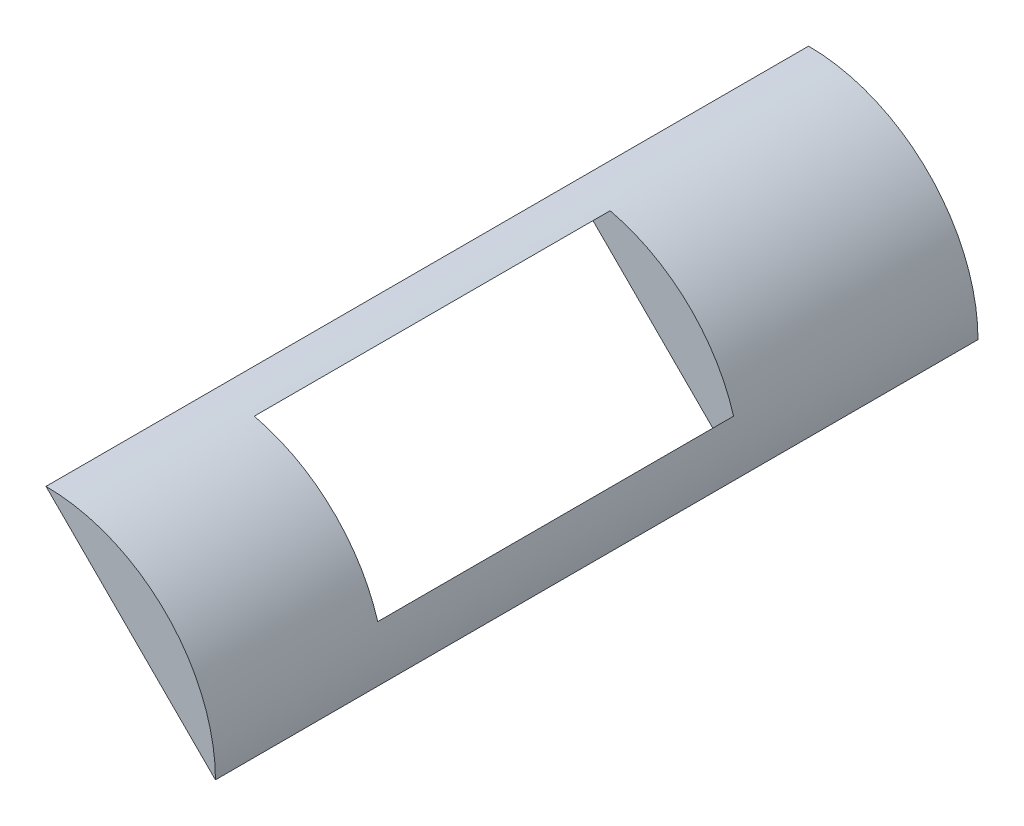
ISO-10303-21;
HEADER;
FILE_DESCRIPTION(('STEP AP214'),'2;1');
FILE_NAME('part.step','',(''),(''),'','','');
FILE_SCHEMA(('AUTOMOTIVE_DESIGN { 1 0 10303 214 1 1 1 1 }'));
ENDSEC;
DATA;
#1=APPLICATION_CONTEXT('core data for automotive mechanical design processes');
#2=APPLICATION_PROTOCOL_DEFINITION('international standard','automotive_design',2000,#1);
#3=PRODUCT_CONTEXT('',#1,'mechanical');
#4=PRODUCT('Part','Part','',(#3));
#5=PRODUCT_RELATED_PRODUCT_CATEGORY('part','',(#4));
#6=PRODUCT_DEFINITION_FORMATION('','',#4);
#7=PRODUCT_DEFINITION_CONTEXT('part definition',#1,'design');
#8=PRODUCT_DEFINITION('design','',#6,#7);
#9=PRODUCT_DEFINITION_SHAPE('','',#8);
#10=(LENGTH_UNIT() NAMED_UNIT(*) SI_UNIT(.MILLI.,.METRE.));
#11=(NAMED_UNIT(*) PLANE_ANGLE_UNIT() SI_UNIT($,.RADIAN.));
#12=(NAMED_UNIT(*) SI_UNIT($,.STERADIAN.) SOLID_ANGLE_UNIT());
#13=UNCERTAINTY_MEASURE_WITH_UNIT(LENGTH_MEASURE(1.E-05),#10,'distance_accuracy_value','');
#14=(GEOMETRIC_REPRESENTATION_CONTEXT(3) GLOBAL_UNCERTAINTY_ASSIGNED_CONTEXT((#13)) GLOBAL_UNIT_ASSIGNED_CONTEXT((#10,
#11,#12)) REPRESENTATION_CONTEXT('',''));
#15=CARTESIAN_POINT('',(0.,0.,0.));
#16=DIRECTION('',(0.,0.,1.));
#17=DIRECTION('',(1.,0.,0.));
#18=AXIS2_PLACEMENT_3D('',#15,#16,#17);
#19=CARTESIAN_POINT('',(0.,0.,45.));
#20=DIRECTION('',(0.,0.,-1.));
#21=DIRECTION('',(-1.,0.,0.));
#22=AXIS2_PLACEMENT_3D('',#19,#20,#21);
#23=CYLINDRICAL_SURFACE('',#22,10.);
#24=DIRECTION('',(0.,0.,-1.));
#25=VECTOR('',#24,1.);
#26=CARTESIAN_POINT('',(2.29191811538282,9.73381278597344,45.));
#27=LINE('',#26,#25);
#28=CARTESIAN_POINT('',(2.29191811538282,9.73381278597344,35.));
#29=VERTEX_POINT('',#28);
#30=CARTESIAN_POINT('',(2.29191811538284,9.73381278597345,14.));
#31=VERTEX_POINT('',#30);
#32=EDGE_CURVE('E120',#29,#31,#27,.T.);
#33=ORIENTED_EDGE('',*,*,#32,.T.);
#34=CARTESIAN_POINT('',(0.,0.,14.));
#35=DIRECTION('',(0.,0.,-1.));
#36=DIRECTION('',(0.,1.,0.));
#37=AXIS2_PLACEMENT_3D('',#34,#35,#36);
#38=CIRCLE('',#37,10.);
#39=CARTESIAN_POINT('',(9.57721392315224,2.8769729700119,14.));
#40=VERTEX_POINT('',#39);
#41=EDGE_CURVE('E123',#31,#40,#38,.T.);
#42=ORIENTED_EDGE('',*,*,#41,.T.);
#43=DIRECTION('',(0.,0.,-1.));
#44=VECTOR('',#43,1.);
#45=CARTESIAN_POINT('',(9.57721392315223,2.87697297001189,45.));
#46=LINE('',#45,#44);
#47=CARTESIAN_POINT('',(9.57721392315223,2.87697297001189,35.));
#48=VERTEX_POINT('',#47);
#49=EDGE_CURVE('E115',#40,#48,#46,.F.);
#50=ORIENTED_EDGE('',*,*,#49,.T.);
#51=CARTESIAN_POINT('',(0.,0.,35.));
#52=DIRECTION('',(0.,0.,1.));
#53=DIRECTION('',(1.,0.,0.));
#54=AXIS2_PLACEMENT_3D('',#51,#52,#53);
#55=CIRCLE('',#54,10.);
#56=EDGE_CURVE('E95',#48,#29,#55,.T.);
#57=ORIENTED_EDGE('',*,*,#56,.T.);
#58=EDGE_LOOP('',(#33,#42,#50,#57));
#59=FACE_BOUND('',#58,.T.);
#60=CARTESIAN_POINT('',(0.,0.,0.));
#61=DIRECTION('',(0.,0.,1.));
#62=DIRECTION('',(1.,0.,0.));
#63=AXIS2_PLACEMENT_3D('',#60,#61,#62);
#64=CIRCLE('',#63,10.);
#65=CARTESIAN_POINT('',(10.,0.,0.));
#66=VERTEX_POINT('',#65);
#67=CARTESIAN_POINT('',(0.,10.,0.));
#68=VERTEX_POINT('',#67);
#69=EDGE_CURVE('E128',#66,#68,#64,.T.);
#70=ORIENTED_EDGE('',*,*,#69,.T.);
#71=DIRECTION('',(0.,0.,-1.));
#72=VECTOR('',#71,1.);
#73=CARTESIAN_POINT('',(0.,10.,45.));
#74=LINE('',#73,#72);
#75=CARTESIAN_POINT('',(0.,10.,45.));
#76=VERTEX_POINT('',#75);
#77=EDGE_CURVE('E132',#76,#68,#74,.T.);
#78=ORIENTED_EDGE('',*,*,#77,.F.);
#79=CARTESIAN_POINT('',(0.,0.,45.));
#80=DIRECTION('',(0.,0.,1.));
#81=DIRECTION('',(1.,0.,0.));
#82=AXIS2_PLACEMENT_3D('',#79,#80,#81);
#83=CIRCLE('',#82,10.);
#84=CARTESIAN_POINT('',(10.,0.,45.));
#85=VERTEX_POINT('',#84);
#86=EDGE_CURVE('E129',#85,#76,#83,.T.);
#87=ORIENTED_EDGE('',*,*,#86,.F.);
#88=DIRECTION('',(0.,0.,-1.));
#89=VECTOR('',#88,1.);
#90=CARTESIAN_POINT('',(10.,0.,45.));
#91=LINE('',#90,#89);
#92=EDGE_CURVE('E44',#85,#66,#91,.T.);
#93=ORIENTED_EDGE('',*,*,#92,.T.);
#94=EDGE_LOOP('',(#70,#78,#87,#93));
#95=FACE_BOUND('',#94,.T.);
#96=ADVANCED_FACE('F37',(#59,#95),#23,.T.);
#97=CARTESIAN_POINT('',(0.,0.,45.));
#98=DIRECTION('',(0.,0.,1.));
#99=DIRECTION('',(1.,0.,0.));
#100=AXIS2_PLACEMENT_3D('',#97,#98,#99);
#101=PLANE('',#100);
#102=DIRECTION('',(-0.707106781186548,0.707106781186548,0.));
#103=VECTOR('',#102,1.);
#104=CARTESIAN_POINT('',(0.,10.,45.));
#105=LINE('',#104,#103);
#106=EDGE_CURVE('E126',#85,#76,#105,.T.);
#107=ORIENTED_EDGE('',*,*,#106,.F.);
#108=ORIENTED_EDGE('',*,*,#86,.T.);
#109=EDGE_LOOP('',(#107,#108));
#110=FACE_BOUND('',#109,.T.);
#111=ADVANCED_FACE('F142',(#110),#101,.T.);
#112=CARTESIAN_POINT('',(0.,0.,0.));
#113=DIRECTION('',(0.,0.,1.));
#114=DIRECTION('',(1.,0.,0.));
#115=AXIS2_PLACEMENT_3D('',#112,#113,#114);
#116=PLANE('',#115);
#117=ORIENTED_EDGE('',*,*,#69,.F.);
#118=DIRECTION('',(-0.707106781186548,0.707106781186548,0.));
#119=VECTOR('',#118,1.);
#120=CARTESIAN_POINT('',(5.,5.,0.));
#121=LINE('',#120,#119);
#122=EDGE_CURVE('E11',#66,#68,#121,.T.);
#123=ORIENTED_EDGE('',*,*,#122,.T.);
#124=EDGE_LOOP('',(#117,#123));
#125=FACE_BOUND('',#124,.T.);
#126=ADVANCED_FACE('F144',(#125),#116,.F.);
#127=CARTESIAN_POINT('',(0.,10.,-15.));
#128=DIRECTION('',(0.707106781186547,0.707106781186547,0.));
#129=DIRECTION('',(-0.707106781186548,0.707106781186548,0.));
#130=AXIS2_PLACEMENT_3D('',#127,#128,#129);
#131=PLANE('',#130);
#132=DIRECTION('',(0.,0.,1.));
#133=VECTOR('',#132,1.);
#134=CARTESIAN_POINT('',(8.35012047657017,1.64987952342983,14.));
#135=LINE('',#134,#133);
#136=CARTESIAN_POINT('',(8.35012047657017,1.64987952342983,14.));
#137=VERTEX_POINT('',#136);
#138=CARTESIAN_POINT('',(8.35012047657017,1.64987952342983,35.));
#139=VERTEX_POINT('',#138);
#140=EDGE_CURVE('E101',#137,#139,#135,.T.);
#141=ORIENTED_EDGE('',*,*,#140,.F.);
#142=DIRECTION('',(0.707106781186547,-0.707106781186548,0.));
#143=VECTOR('',#142,1.);
#144=CARTESIAN_POINT('',(1.27905266470469,8.72094733529531,14.));
#145=LINE('',#144,#143);
#146=CARTESIAN_POINT('',(1.27905266470469,8.72094733529531,14.));
#147=VERTEX_POINT('',#146);
#148=EDGE_CURVE('E59',#147,#137,#145,.T.);
#149=ORIENTED_EDGE('',*,*,#148,.F.);
#150=DIRECTION('',(0.,0.,-1.));
#151=VECTOR('',#150,1.);
#152=CARTESIAN_POINT('',(1.27905266470469,8.72094733529531,14.));
#153=LINE('',#152,#151);
#154=CARTESIAN_POINT('',(1.27905266470469,8.72094733529531,35.));
#155=VERTEX_POINT('',#154);
#156=EDGE_CURVE('E108',#155,#147,#153,.T.);
#157=ORIENTED_EDGE('',*,*,#156,.F.);
#158=DIRECTION('',(-0.707106781186547,0.707106781186548,0.));
#159=VECTOR('',#158,1.);
#160=CARTESIAN_POINT('',(1.27905266470469,8.72094733529531,35.));
#161=LINE('',#160,#159);
#162=EDGE_CURVE('E92',#139,#155,#161,.T.);
#163=ORIENTED_EDGE('',*,*,#162,.F.);
#164=EDGE_LOOP('',(#141,#149,#157,#163));
#165=FACE_BOUND('',#164,.T.);
#166=ORIENTED_EDGE('',*,*,#92,.F.);
#167=ORIENTED_EDGE('',*,*,#106,.T.);
#168=ORIENTED_EDGE('',*,*,#77,.T.);
#169=ORIENTED_EDGE('',*,*,#122,.F.);
#170=EDGE_LOOP('',(#166,#167,#168,#169));
#171=FACE_BOUND('',#170,.T.);
#172=ADVANCED_FACE('F105',(#165,#171),#131,.F.);
#173=CARTESIAN_POINT('',(43.7054595358976,51.1473542064882,14.));
#174=DIRECTION('',(0.,0.,-1.));
#175=DIRECTION('',(0.,1.,0.));
#176=AXIS2_PLACEMENT_3D('',#173,#174,#175);
#177=PLANE('',#176);
#178=DIRECTION('',(-0.707106781186548,-0.707106781186547,0.));
#179=VECTOR('',#178,1.);
#180=CARTESIAN_POINT('',(43.7054595358976,51.1473542064882,14.));
#181=LINE('',#180,#179);
#182=EDGE_CURVE('E113',#31,#147,#181,.T.);
#183=ORIENTED_EDGE('',*,*,#182,.T.);
#184=ORIENTED_EDGE('',*,*,#148,.T.);
#185=DIRECTION('',(-0.707106781186548,-0.707106781186547,0.));
#186=VECTOR('',#185,1.);
#187=CARTESIAN_POINT('',(50.776527347763,44.0762863946227,14.));
#188=LINE('',#187,#186);
#189=EDGE_CURVE('E98',#40,#137,#188,.T.);
#190=ORIENTED_EDGE('',*,*,#189,.F.);
#191=ORIENTED_EDGE('',*,*,#41,.F.);
#192=EDGE_LOOP('',(#183,#184,#190,#191));
#193=FACE_BOUND('',#192,.T.);
#194=ADVANCED_FACE('F150',(#193),#177,.F.);
#195=CARTESIAN_POINT('',(43.7054595358976,51.1473542064882,14.));
#196=DIRECTION('',(-0.707106781186547,0.707106781186548,0.));
#197=DIRECTION('',(-0.707106781186548,-0.707106781186547,0.));
#198=AXIS2_PLACEMENT_3D('',#195,#196,#197);
#199=PLANE('',#198);
#200=DIRECTION('',(-0.707106781186548,-0.707106781186547,0.));
#201=VECTOR('',#200,1.);
#202=CARTESIAN_POINT('',(43.7054595358976,51.1473542064882,35.));
#203=LINE('',#202,#201);
#204=EDGE_CURVE('E97',#29,#155,#203,.T.);
#205=ORIENTED_EDGE('',*,*,#204,.T.);
#206=ORIENTED_EDGE('',*,*,#156,.T.);
#207=ORIENTED_EDGE('',*,*,#182,.F.);
#208=ORIENTED_EDGE('',*,*,#32,.F.);
#209=EDGE_LOOP('',(#205,#206,#207,#208));
#210=FACE_BOUND('',#209,.T.);
#211=ADVANCED_FACE('F159',(#210),#199,.F.);
#212=CARTESIAN_POINT('',(43.7054595358976,51.1473542064882,35.));
#213=DIRECTION('',(0.,0.,1.));
#214=DIRECTION('',(1.,0.,0.));
#215=AXIS2_PLACEMENT_3D('',#212,#213,#214);
#216=PLANE('',#215);
#217=DIRECTION('',(-0.707106781186548,-0.707106781186547,0.));
#218=VECTOR('',#217,1.);
#219=CARTESIAN_POINT('',(50.776527347763,44.0762863946227,35.));
#220=LINE('',#219,#218);
#221=EDGE_CURVE('E51',#48,#139,#220,.T.);
#222=ORIENTED_EDGE('',*,*,#221,.T.);
#223=ORIENTED_EDGE('',*,*,#162,.T.);
#224=ORIENTED_EDGE('',*,*,#204,.F.);
#225=ORIENTED_EDGE('',*,*,#56,.F.);
#226=EDGE_LOOP('',(#222,#223,#224,#225));
#227=FACE_BOUND('',#226,.T.);
#228=ADVANCED_FACE('F89',(#227),#216,.F.);
#229=CARTESIAN_POINT('',(50.776527347763,44.0762863946227,14.));
#230=DIRECTION('',(0.707106781186547,-0.707106781186548,0.));
#231=DIRECTION('',(0.707106781186548,0.707106781186547,0.));
#232=AXIS2_PLACEMENT_3D('',#229,#230,#231);
#233=PLANE('',#232);
#234=ORIENTED_EDGE('',*,*,#189,.T.);
#235=ORIENTED_EDGE('',*,*,#140,.T.);
#236=ORIENTED_EDGE('',*,*,#221,.F.);
#237=ORIENTED_EDGE('',*,*,#49,.F.);
#238=EDGE_LOOP('',(#234,#235,#236,#237));
#239=FACE_BOUND('',#238,.T.);
#240=ADVANCED_FACE('F102',(#239),#233,.F.);
#241=CLOSED_SHELL('',(#96,#111,#126,#172,#194,#211,#228,#240));
#242=MANIFOLD_SOLID_BREP('B2',#241);
#243=ADVANCED_BREP_SHAPE_REPRESENTATION('',(#18,#242),#14);
#244=SHAPE_DEFINITION_REPRESENTATION(#9,#243);
ENDSEC;
END-ISO-10303-21;
